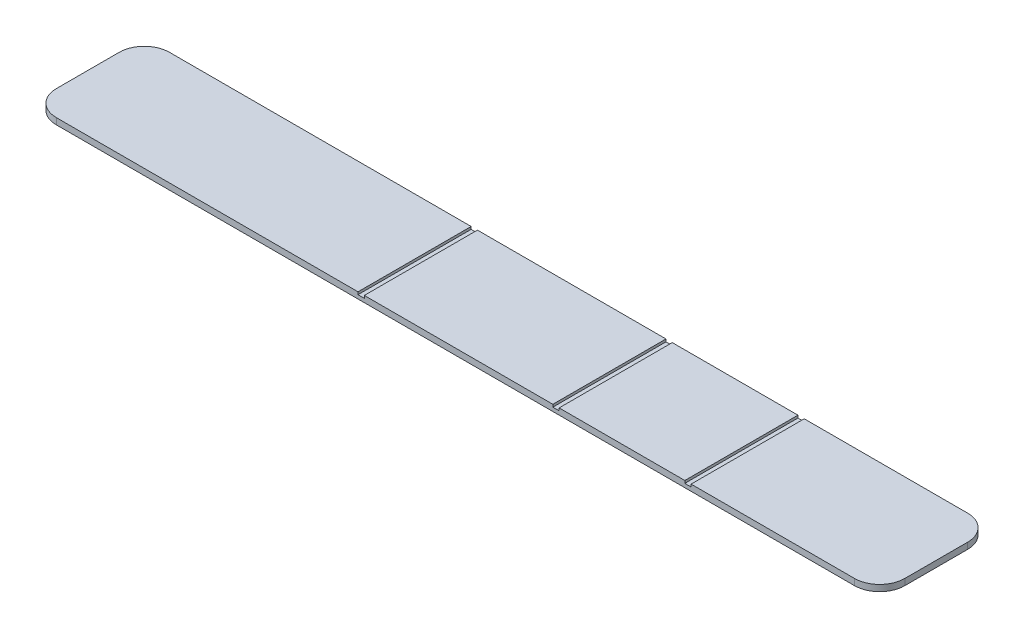
ISO-10303-21;
HEADER;
FILE_DESCRIPTION(('STEP AP214'),'2;1');
FILE_NAME('part.step','',(''),(''),'','','');
FILE_SCHEMA(('AUTOMOTIVE_DESIGN { 1 0 10303 214 1 1 1 1 }'));
ENDSEC;
DATA;
#1=APPLICATION_CONTEXT('core data for automotive mechanical design processes');
#2=APPLICATION_PROTOCOL_DEFINITION('international standard','automotive_design',2000,#1);
#3=PRODUCT_CONTEXT('',#1,'mechanical');
#4=PRODUCT('Part','Part','',(#3));
#5=PRODUCT_RELATED_PRODUCT_CATEGORY('part','',(#4));
#6=PRODUCT_DEFINITION_FORMATION('','',#4);
#7=PRODUCT_DEFINITION_CONTEXT('part definition',#1,'design');
#8=PRODUCT_DEFINITION('design','',#6,#7);
#9=PRODUCT_DEFINITION_SHAPE('','',#8);
#10=(LENGTH_UNIT() NAMED_UNIT(*) SI_UNIT(.MILLI.,.METRE.));
#11=(NAMED_UNIT(*) PLANE_ANGLE_UNIT() SI_UNIT($,.RADIAN.));
#12=(NAMED_UNIT(*) SI_UNIT($,.STERADIAN.) SOLID_ANGLE_UNIT());
#13=UNCERTAINTY_MEASURE_WITH_UNIT(LENGTH_MEASURE(1.E-05),#10,'distance_accuracy_value','');
#14=(GEOMETRIC_REPRESENTATION_CONTEXT(3) GLOBAL_UNCERTAINTY_ASSIGNED_CONTEXT((#13)) GLOBAL_UNIT_ASSIGNED_CONTEXT((#10,
#11,#12)) REPRESENTATION_CONTEXT('',''));
#15=CARTESIAN_POINT('',(0.,0.,0.));
#16=DIRECTION('',(0.,0.,1.));
#17=DIRECTION('',(1.,0.,0.));
#18=AXIS2_PLACEMENT_3D('',#15,#16,#17);
#19=CARTESIAN_POINT('',(0.,1.,0.));
#20=DIRECTION('',(0.,1.,0.));
#21=DIRECTION('',(0.,0.,1.));
#22=AXIS2_PLACEMENT_3D('',#19,#20,#21);
#23=PLANE('',#22);
#24=DIRECTION('',(1.,0.,0.));
#25=VECTOR('',#24,1.);
#26=CARTESIAN_POINT('',(0.,1.,-18.));
#27=LINE('',#26,#25);
#28=CARTESIAN_POINT('',(4.,1.,-18.));
#29=VERTEX_POINT('',#28);
#30=CARTESIAN_POINT('',(52.,1.,-18.));
#31=VERTEX_POINT('',#30);
#32=EDGE_CURVE('E271',#29,#31,#27,.T.);
#33=ORIENTED_EDGE('',*,*,#32,.F.);
#34=CARTESIAN_POINT('',(4.,1.,-14.));
#35=DIRECTION('',(0.,1.,0.));
#36=DIRECTION('',(0.,0.,1.));
#37=AXIS2_PLACEMENT_3D('',#34,#35,#36);
#38=CIRCLE('',#37,4.);
#39=CARTESIAN_POINT('',(0.,1.,-14.));
#40=VERTEX_POINT('',#39);
#41=EDGE_CURVE('E11',#29,#40,#38,.T.);
#42=ORIENTED_EDGE('',*,*,#41,.T.);
#43=DIRECTION('',(0.,0.,-1.));
#44=VECTOR('',#43,1.);
#45=CARTESIAN_POINT('',(0.,1.,0.));
#46=LINE('',#45,#44);
#47=CARTESIAN_POINT('',(0.,1.,-4.));
#48=VERTEX_POINT('',#47);
#49=EDGE_CURVE('E273',#48,#40,#46,.T.);
#50=ORIENTED_EDGE('',*,*,#49,.F.);
#51=CARTESIAN_POINT('',(4.,1.,-4.));
#52=DIRECTION('',(0.,1.,0.));
#53=DIRECTION('',(0.,0.,1.));
#54=AXIS2_PLACEMENT_3D('',#51,#52,#53);
#55=CIRCLE('',#54,4.);
#56=CARTESIAN_POINT('',(4.,1.,0.));
#57=VERTEX_POINT('',#56);
#58=EDGE_CURVE('E41',#48,#57,#55,.T.);
#59=ORIENTED_EDGE('',*,*,#58,.T.);
#60=DIRECTION('',(1.,0.,0.));
#61=VECTOR('',#60,1.);
#62=CARTESIAN_POINT('',(0.,1.,0.));
#63=LINE('',#62,#61);
#64=CARTESIAN_POINT('',(52.,1.,0.));
#65=VERTEX_POINT('',#64);
#66=EDGE_CURVE('E263',#57,#65,#63,.T.);
#67=ORIENTED_EDGE('',*,*,#66,.T.);
#68=DIRECTION('',(0.,0.,1.));
#69=VECTOR('',#68,1.);
#70=CARTESIAN_POINT('',(52.,1.,-18.));
#71=LINE('',#70,#69);
#72=EDGE_CURVE('E177',#31,#65,#71,.T.);
#73=ORIENTED_EDGE('',*,*,#72,.F.);
#74=EDGE_LOOP('',(#33,#42,#50,#59,#67,#73));
#75=FACE_BOUND('',#74,.T.);
#76=ADVANCED_FACE('F33',(#75),#23,.T.);
#77=DIRECTION('',(0.,0.,-1.));
#78=VECTOR('',#77,1.);
#79=CARTESIAN_POINT('',(53.,1.,-18.));
#80=LINE('',#79,#78);
#81=CARTESIAN_POINT('',(53.,1.,0.));
#82=VERTEX_POINT('',#81);
#83=CARTESIAN_POINT('',(53.,1.,-18.));
#84=VERTEX_POINT('',#83);
#85=EDGE_CURVE('E192',#82,#84,#80,.T.);
#86=ORIENTED_EDGE('',*,*,#85,.F.);
#87=CARTESIAN_POINT('',(83.,1.,0.));
#88=VERTEX_POINT('',#87);
#89=EDGE_CURVE('E266',#82,#88,#63,.T.);
#90=ORIENTED_EDGE('',*,*,#89,.T.);
#91=DIRECTION('',(0.,0.,1.));
#92=VECTOR('',#91,1.);
#93=CARTESIAN_POINT('',(83.,1.,-18.));
#94=LINE('',#93,#92);
#95=CARTESIAN_POINT('',(83.,1.,-18.));
#96=VERTEX_POINT('',#95);
#97=EDGE_CURVE('E226',#96,#88,#94,.T.);
#98=ORIENTED_EDGE('',*,*,#97,.F.);
#99=EDGE_CURVE('E274',#84,#96,#27,.T.);
#100=ORIENTED_EDGE('',*,*,#99,.F.);
#101=EDGE_LOOP('',(#86,#90,#98,#100));
#102=FACE_BOUND('',#101,.T.);
#103=ADVANCED_FACE('F362',(#102),#23,.T.);
#104=DIRECTION('',(0.,0.,-1.));
#105=VECTOR('',#104,1.);
#106=CARTESIAN_POINT('',(84.,1.,-18.));
#107=LINE('',#106,#105);
#108=CARTESIAN_POINT('',(84.,1.,0.));
#109=VERTEX_POINT('',#108);
#110=CARTESIAN_POINT('',(84.,1.,-18.));
#111=VERTEX_POINT('',#110);
#112=EDGE_CURVE('E216',#109,#111,#107,.T.);
#113=ORIENTED_EDGE('',*,*,#112,.F.);
#114=CARTESIAN_POINT('',(104.,1.,0.));
#115=VERTEX_POINT('',#114);
#116=EDGE_CURVE('E352',#109,#115,#63,.T.);
#117=ORIENTED_EDGE('',*,*,#116,.T.);
#118=DIRECTION('',(0.,0.,1.));
#119=VECTOR('',#118,1.);
#120=CARTESIAN_POINT('',(104.,1.,-18.));
#121=LINE('',#120,#119);
#122=CARTESIAN_POINT('',(104.,1.,-18.));
#123=VERTEX_POINT('',#122);
#124=EDGE_CURVE('E252',#123,#115,#121,.T.);
#125=ORIENTED_EDGE('',*,*,#124,.F.);
#126=EDGE_CURVE('E373',#111,#123,#27,.T.);
#127=ORIENTED_EDGE('',*,*,#126,.F.);
#128=EDGE_LOOP('',(#113,#117,#125,#127));
#129=FACE_BOUND('',#128,.T.);
#130=ADVANCED_FACE('F378',(#129),#23,.T.);
#131=CARTESIAN_POINT('',(0.,1.,0.));
#132=DIRECTION('',(0.,0.,-1.));
#133=DIRECTION('',(-1.,0.,0.));
#134=AXIS2_PLACEMENT_3D('',#131,#132,#133);
#135=PLANE('',#134);
#136=DIRECTION('',(1.,0.,0.));
#137=VECTOR('',#136,1.);
#138=CARTESIAN_POINT('',(0.,0.,0.));
#139=LINE('',#138,#137);
#140=CARTESIAN_POINT('',(4.,0.,0.));
#141=VERTEX_POINT('',#140);
#142=CARTESIAN_POINT('',(131.,0.,0.));
#143=VERTEX_POINT('',#142);
#144=EDGE_CURVE('E207',#141,#143,#139,.T.);
#145=ORIENTED_EDGE('',*,*,#144,.T.);
#146=DIRECTION('',(0.,-1.,0.));
#147=VECTOR('',#146,1.);
#148=CARTESIAN_POINT('',(131.,1.,0.));
#149=LINE('',#148,#147);
#150=CARTESIAN_POINT('',(131.,1.,0.));
#151=VERTEX_POINT('',#150);
#152=EDGE_CURVE('E311',#143,#151,#149,.F.);
#153=ORIENTED_EDGE('',*,*,#152,.T.);
#154=CARTESIAN_POINT('',(105.,1.,0.));
#155=VERTEX_POINT('',#154);
#156=EDGE_CURVE('E267',#155,#151,#63,.T.);
#157=ORIENTED_EDGE('',*,*,#156,.F.);
#158=DIRECTION('',(0.,1.,0.));
#159=VECTOR('',#158,1.);
#160=CARTESIAN_POINT('',(105.,0.6,0.));
#161=LINE('',#160,#159);
#162=CARTESIAN_POINT('',(105.,0.6,0.));
#163=VERTEX_POINT('',#162);
#164=EDGE_CURVE('E259',#163,#155,#161,.T.);
#165=ORIENTED_EDGE('',*,*,#164,.F.);
#166=DIRECTION('',(1.,0.,0.));
#167=VECTOR('',#166,1.);
#168=CARTESIAN_POINT('',(104.,0.6,0.));
#169=LINE('',#168,#167);
#170=CARTESIAN_POINT('',(104.,0.6,0.));
#171=VERTEX_POINT('',#170);
#172=EDGE_CURVE('E241',#171,#163,#169,.T.);
#173=ORIENTED_EDGE('',*,*,#172,.F.);
#174=DIRECTION('',(0.,1.,0.));
#175=VECTOR('',#174,1.);
#176=CARTESIAN_POINT('',(104.,0.6,0.));
#177=LINE('',#176,#175);
#178=EDGE_CURVE('E251',#171,#115,#177,.T.);
#179=ORIENTED_EDGE('',*,*,#178,.T.);
#180=ORIENTED_EDGE('',*,*,#116,.F.);
#181=DIRECTION('',(0.,1.,0.));
#182=VECTOR('',#181,1.);
#183=CARTESIAN_POINT('',(84.,0.6,0.));
#184=LINE('',#183,#182);
#185=CARTESIAN_POINT('',(84.,0.6,0.));
#186=VERTEX_POINT('',#185);
#187=EDGE_CURVE('E234',#186,#109,#184,.T.);
#188=ORIENTED_EDGE('',*,*,#187,.F.);
#189=DIRECTION('',(1.,0.,0.));
#190=VECTOR('',#189,1.);
#191=CARTESIAN_POINT('',(83.,0.6,0.));
#192=LINE('',#191,#190);
#193=CARTESIAN_POINT('',(83.,0.6,0.));
#194=VERTEX_POINT('',#193);
#195=EDGE_CURVE('E215',#194,#186,#192,.T.);
#196=ORIENTED_EDGE('',*,*,#195,.F.);
#197=DIRECTION('',(0.,1.,0.));
#198=VECTOR('',#197,1.);
#199=CARTESIAN_POINT('',(83.,0.6,0.));
#200=LINE('',#199,#198);
#201=EDGE_CURVE('E225',#194,#88,#200,.T.);
#202=ORIENTED_EDGE('',*,*,#201,.T.);
#203=ORIENTED_EDGE('',*,*,#89,.F.);
#204=DIRECTION('',(0.,1.,0.));
#205=VECTOR('',#204,1.);
#206=CARTESIAN_POINT('',(53.,0.6,0.));
#207=LINE('',#206,#205);
#208=CARTESIAN_POINT('',(53.,0.6,0.));
#209=VERTEX_POINT('',#208);
#210=EDGE_CURVE('E181',#209,#82,#207,.T.);
#211=ORIENTED_EDGE('',*,*,#210,.F.);
#212=DIRECTION('',(1.,0.,0.));
#213=VECTOR('',#212,1.);
#214=CARTESIAN_POINT('',(52.,0.6,0.));
#215=LINE('',#214,#213);
#216=CARTESIAN_POINT('',(52.,0.6,0.));
#217=VERTEX_POINT('',#216);
#218=EDGE_CURVE('E188',#217,#209,#215,.T.);
#219=ORIENTED_EDGE('',*,*,#218,.F.);
#220=DIRECTION('',(0.,1.,0.));
#221=VECTOR('',#220,1.);
#222=CARTESIAN_POINT('',(52.,0.6,0.));
#223=LINE('',#222,#221);
#224=EDGE_CURVE('E170',#217,#65,#223,.T.);
#225=ORIENTED_EDGE('',*,*,#224,.T.);
#226=ORIENTED_EDGE('',*,*,#66,.F.);
#227=DIRECTION('',(0.,-1.,0.));
#228=VECTOR('',#227,1.);
#229=CARTESIAN_POINT('',(4.,0.,0.));
#230=LINE('',#229,#228);
#231=EDGE_CURVE('E308',#57,#141,#230,.T.);
#232=ORIENTED_EDGE('',*,*,#231,.T.);
#233=EDGE_LOOP('',(#145,#153,#157,#165,#173,#179,#180,#188,#196,#202,#203,#211,#219,#225,#226,#232));
#234=FACE_BOUND('',#233,.T.);
#235=ADVANCED_FACE('F195',(#234),#135,.F.);
#236=CARTESIAN_POINT('',(135.,1.,0.));
#237=DIRECTION('',(-1.,0.,0.));
#238=DIRECTION('',(0.,0.,1.));
#239=AXIS2_PLACEMENT_3D('',#236,#237,#238);
#240=PLANE('',#239);
#241=DIRECTION('',(0.,0.,-1.));
#242=VECTOR('',#241,1.);
#243=CARTESIAN_POINT('',(135.,0.,0.));
#244=LINE('',#243,#242);
#245=CARTESIAN_POINT('',(135.,0.,-4.));
#246=VERTEX_POINT('',#245);
#247=CARTESIAN_POINT('',(135.,0.,-14.));
#248=VERTEX_POINT('',#247);
#249=EDGE_CURVE('E278',#246,#248,#244,.T.);
#250=ORIENTED_EDGE('',*,*,#249,.T.);
#251=DIRECTION('',(0.,-1.,0.));
#252=VECTOR('',#251,1.);
#253=CARTESIAN_POINT('',(135.,1.,-14.));
#254=LINE('',#253,#252);
#255=CARTESIAN_POINT('',(135.,1.,-14.));
#256=VERTEX_POINT('',#255);
#257=EDGE_CURVE('E302',#248,#256,#254,.F.);
#258=ORIENTED_EDGE('',*,*,#257,.T.);
#259=DIRECTION('',(0.,0.,-1.));
#260=VECTOR('',#259,1.);
#261=CARTESIAN_POINT('',(135.,1.,0.));
#262=LINE('',#261,#260);
#263=CARTESIAN_POINT('',(135.,1.,-4.));
#264=VERTEX_POINT('',#263);
#265=EDGE_CURVE('E265',#264,#256,#262,.T.);
#266=ORIENTED_EDGE('',*,*,#265,.F.);
#267=DIRECTION('',(0.,-1.,0.));
#268=VECTOR('',#267,1.);
#269=CARTESIAN_POINT('',(135.,1.,-4.));
#270=LINE('',#269,#268);
#271=EDGE_CURVE('E299',#264,#246,#270,.T.);
#272=ORIENTED_EDGE('',*,*,#271,.T.);
#273=EDGE_LOOP('',(#250,#258,#266,#272));
#274=FACE_BOUND('',#273,.T.);
#275=ADVANCED_FACE('F339',(#274),#240,.F.);
#276=CARTESIAN_POINT('',(0.,1.,-18.));
#277=DIRECTION('',(0.,0.,-1.));
#278=DIRECTION('',(-1.,0.,0.));
#279=AXIS2_PLACEMENT_3D('',#276,#277,#278);
#280=PLANE('',#279);
#281=CARTESIAN_POINT('',(105.,1.,-18.));
#282=VERTEX_POINT('',#281);
#283=CARTESIAN_POINT('',(131.,1.,-18.));
#284=VERTEX_POINT('',#283);
#285=EDGE_CURVE('E270',#282,#284,#27,.T.);
#286=ORIENTED_EDGE('',*,*,#285,.T.);
#287=DIRECTION('',(0.,-1.,0.));
#288=VECTOR('',#287,1.);
#289=CARTESIAN_POINT('',(131.,0.,-18.));
#290=LINE('',#289,#288);
#291=CARTESIAN_POINT('',(131.,0.,-18.));
#292=VERTEX_POINT('',#291);
#293=EDGE_CURVE('E288',#284,#292,#290,.T.);
#294=ORIENTED_EDGE('',*,*,#293,.T.);
#295=DIRECTION('',(1.,0.,0.));
#296=VECTOR('',#295,1.);
#297=CARTESIAN_POINT('',(0.,0.,-18.));
#298=LINE('',#297,#296);
#299=CARTESIAN_POINT('',(4.,0.,-18.));
#300=VERTEX_POINT('',#299);
#301=EDGE_CURVE('E281',#300,#292,#298,.T.);
#302=ORIENTED_EDGE('',*,*,#301,.F.);
#303=DIRECTION('',(0.,-1.,0.));
#304=VECTOR('',#303,1.);
#305=CARTESIAN_POINT('',(4.,1.,-18.));
#306=LINE('',#305,#304);
#307=EDGE_CURVE('E276',#300,#29,#306,.F.);
#308=ORIENTED_EDGE('',*,*,#307,.T.);
#309=ORIENTED_EDGE('',*,*,#32,.T.);
#310=DIRECTION('',(0.,1.,0.));
#311=VECTOR('',#310,1.);
#312=CARTESIAN_POINT('',(52.,0.6,-18.));
#313=LINE('',#312,#311);
#314=CARTESIAN_POINT('',(52.,0.6,-18.));
#315=VERTEX_POINT('',#314);
#316=EDGE_CURVE('E205',#315,#31,#313,.T.);
#317=ORIENTED_EDGE('',*,*,#316,.F.);
#318=DIRECTION('',(-1.,0.,0.));
#319=VECTOR('',#318,1.);
#320=CARTESIAN_POINT('',(52.,0.6,-18.));
#321=LINE('',#320,#319);
#322=CARTESIAN_POINT('',(53.,0.6,-18.));
#323=VERTEX_POINT('',#322);
#324=EDGE_CURVE('E182',#323,#315,#321,.T.);
#325=ORIENTED_EDGE('',*,*,#324,.F.);
#326=DIRECTION('',(0.,1.,0.));
#327=VECTOR('',#326,1.);
#328=CARTESIAN_POINT('',(53.,0.6,-18.));
#329=LINE('',#328,#327);
#330=EDGE_CURVE('E208',#323,#84,#329,.T.);
#331=ORIENTED_EDGE('',*,*,#330,.T.);
#332=ORIENTED_EDGE('',*,*,#99,.T.);
#333=DIRECTION('',(0.,1.,0.));
#334=VECTOR('',#333,1.);
#335=CARTESIAN_POINT('',(83.,0.6,-18.));
#336=LINE('',#335,#334);
#337=CARTESIAN_POINT('',(83.,0.6,-18.));
#338=VERTEX_POINT('',#337);
#339=EDGE_CURVE('E203',#338,#96,#336,.T.);
#340=ORIENTED_EDGE('',*,*,#339,.F.);
#341=DIRECTION('',(-1.,0.,0.));
#342=VECTOR('',#341,1.);
#343=CARTESIAN_POINT('',(83.,0.6,-18.));
#344=LINE('',#343,#342);
#345=CARTESIAN_POINT('',(84.,0.6,-18.));
#346=VERTEX_POINT('',#345);
#347=EDGE_CURVE('E222',#346,#338,#344,.T.);
#348=ORIENTED_EDGE('',*,*,#347,.F.);
#349=DIRECTION('',(0.,1.,0.));
#350=VECTOR('',#349,1.);
#351=CARTESIAN_POINT('',(84.,0.6,-18.));
#352=LINE('',#351,#350);
#353=EDGE_CURVE('E231',#346,#111,#352,.T.);
#354=ORIENTED_EDGE('',*,*,#353,.T.);
#355=ORIENTED_EDGE('',*,*,#126,.T.);
#356=DIRECTION('',(0.,1.,0.));
#357=VECTOR('',#356,1.);
#358=CARTESIAN_POINT('',(104.,0.6,-18.));
#359=LINE('',#358,#357);
#360=CARTESIAN_POINT('',(104.,0.6,-18.));
#361=VERTEX_POINT('',#360);
#362=EDGE_CURVE('E228',#361,#123,#359,.T.);
#363=ORIENTED_EDGE('',*,*,#362,.F.);
#364=DIRECTION('',(-1.,0.,0.));
#365=VECTOR('',#364,1.);
#366=CARTESIAN_POINT('',(104.,0.6,-18.));
#367=LINE('',#366,#365);
#368=CARTESIAN_POINT('',(105.,0.6,-18.));
#369=VERTEX_POINT('',#368);
#370=EDGE_CURVE('E248',#369,#361,#367,.T.);
#371=ORIENTED_EDGE('',*,*,#370,.F.);
#372=DIRECTION('',(0.,1.,0.));
#373=VECTOR('',#372,1.);
#374=CARTESIAN_POINT('',(105.,0.6,-18.));
#375=LINE('',#374,#373);
#376=EDGE_CURVE('E256',#369,#282,#375,.T.);
#377=ORIENTED_EDGE('',*,*,#376,.T.);
#378=EDGE_LOOP('',(#286,#294,#302,#308,#309,#317,#325,#331,#332,#340,#348,#354,#355,#363,#371,#377));
#379=FACE_BOUND('',#378,.T.);
#380=ADVANCED_FACE('F330',(#379),#280,.T.);
#381=CARTESIAN_POINT('',(0.,1.,0.));
#382=DIRECTION('',(-1.,0.,0.));
#383=DIRECTION('',(0.,0.,1.));
#384=AXIS2_PLACEMENT_3D('',#381,#382,#383);
#385=PLANE('',#384);
#386=ORIENTED_EDGE('',*,*,#49,.T.);
#387=DIRECTION('',(0.,-1.,0.));
#388=VECTOR('',#387,1.);
#389=CARTESIAN_POINT('',(0.,1.,-14.));
#390=LINE('',#389,#388);
#391=CARTESIAN_POINT('',(0.,0.,-14.));
#392=VERTEX_POINT('',#391);
#393=EDGE_CURVE('E314',#40,#392,#390,.T.);
#394=ORIENTED_EDGE('',*,*,#393,.T.);
#395=DIRECTION('',(0.,0.,-1.));
#396=VECTOR('',#395,1.);
#397=CARTESIAN_POINT('',(0.,0.,0.));
#398=LINE('',#397,#396);
#399=CARTESIAN_POINT('',(0.,0.,-4.));
#400=VERTEX_POINT('',#399);
#401=EDGE_CURVE('E284',#400,#392,#398,.T.);
#402=ORIENTED_EDGE('',*,*,#401,.F.);
#403=DIRECTION('',(0.,-1.,0.));
#404=VECTOR('',#403,1.);
#405=CARTESIAN_POINT('',(0.,1.,-4.));
#406=LINE('',#405,#404);
#407=EDGE_CURVE('E53',#400,#48,#406,.F.);
#408=ORIENTED_EDGE('',*,*,#407,.T.);
#409=EDGE_LOOP('',(#386,#394,#402,#408));
#410=FACE_BOUND('',#409,.T.);
#411=ADVANCED_FACE('F322',(#410),#385,.T.);
#412=ORIENTED_EDGE('',*,*,#265,.T.);
#413=CARTESIAN_POINT('',(131.,1.,-14.));
#414=DIRECTION('',(0.,1.,0.));
#415=DIRECTION('',(0.,0.,1.));
#416=AXIS2_PLACEMENT_3D('',#413,#414,#415);
#417=CIRCLE('',#416,4.);
#418=EDGE_CURVE('E306',#256,#284,#417,.T.);
#419=ORIENTED_EDGE('',*,*,#418,.T.);
#420=ORIENTED_EDGE('',*,*,#285,.F.);
#421=DIRECTION('',(0.,0.,-1.));
#422=VECTOR('',#421,1.);
#423=CARTESIAN_POINT('',(105.,1.,-18.));
#424=LINE('',#423,#422);
#425=EDGE_CURVE('E242',#155,#282,#424,.T.);
#426=ORIENTED_EDGE('',*,*,#425,.F.);
#427=ORIENTED_EDGE('',*,*,#156,.T.);
#428=CARTESIAN_POINT('',(131.,1.,-4.));
#429=DIRECTION('',(0.,1.,0.));
#430=DIRECTION('',(0.,0.,1.));
#431=AXIS2_PLACEMENT_3D('',#428,#429,#430);
#432=CIRCLE('',#431,4.);
#433=EDGE_CURVE('E304',#151,#264,#432,.T.);
#434=ORIENTED_EDGE('',*,*,#433,.T.);
#435=EDGE_LOOP('',(#412,#419,#420,#426,#427,#434));
#436=FACE_BOUND('',#435,.T.);
#437=ADVANCED_FACE('F351',(#436),#23,.T.);
#438=CARTESIAN_POINT('',(0.,0.,0.));
#439=DIRECTION('',(0.,1.,0.));
#440=DIRECTION('',(0.,0.,1.));
#441=AXIS2_PLACEMENT_3D('',#438,#439,#440);
#442=PLANE('',#441);
#443=ORIENTED_EDGE('',*,*,#301,.T.);
#444=CARTESIAN_POINT('',(131.,0.,-14.));
#445=DIRECTION('',(0.,1.,0.));
#446=DIRECTION('',(0.,0.,1.));
#447=AXIS2_PLACEMENT_3D('',#444,#445,#446);
#448=CIRCLE('',#447,4.);
#449=EDGE_CURVE('E297',#292,#248,#448,.F.);
#450=ORIENTED_EDGE('',*,*,#449,.T.);
#451=ORIENTED_EDGE('',*,*,#249,.F.);
#452=CARTESIAN_POINT('',(131.,0.,-4.));
#453=DIRECTION('',(0.,1.,0.));
#454=DIRECTION('',(0.,0.,1.));
#455=AXIS2_PLACEMENT_3D('',#452,#453,#454);
#456=CIRCLE('',#455,4.);
#457=EDGE_CURVE('E295',#246,#143,#456,.F.);
#458=ORIENTED_EDGE('',*,*,#457,.T.);
#459=ORIENTED_EDGE('',*,*,#144,.F.);
#460=CARTESIAN_POINT('',(4.,0.,-4.));
#461=DIRECTION('',(0.,1.,0.));
#462=DIRECTION('',(0.,0.,1.));
#463=AXIS2_PLACEMENT_3D('',#460,#461,#462);
#464=CIRCLE('',#463,4.);
#465=EDGE_CURVE('E291',#141,#400,#464,.F.);
#466=ORIENTED_EDGE('',*,*,#465,.T.);
#467=ORIENTED_EDGE('',*,*,#401,.T.);
#468=CARTESIAN_POINT('',(4.,0.,-14.));
#469=DIRECTION('',(0.,1.,0.));
#470=DIRECTION('',(0.,0.,1.));
#471=AXIS2_PLACEMENT_3D('',#468,#469,#470);
#472=CIRCLE('',#471,4.);
#473=EDGE_CURVE('E293',#392,#300,#472,.F.);
#474=ORIENTED_EDGE('',*,*,#473,.T.);
#475=EDGE_LOOP('',(#443,#450,#451,#458,#459,#466,#467,#474));
#476=FACE_BOUND('',#475,.T.);
#477=ADVANCED_FACE('F321',(#476),#442,.F.);
#478=CARTESIAN_POINT('',(104.,0.6,-18.));
#479=DIRECTION('',(-1.,0.,0.));
#480=DIRECTION('',(0.,0.,1.));
#481=AXIS2_PLACEMENT_3D('',#478,#479,#480);
#482=PLANE('',#481);
#483=ORIENTED_EDGE('',*,*,#124,.T.);
#484=ORIENTED_EDGE('',*,*,#178,.F.);
#485=DIRECTION('',(0.,0.,1.));
#486=VECTOR('',#485,1.);
#487=CARTESIAN_POINT('',(104.,0.6,-18.));
#488=LINE('',#487,#486);
#489=EDGE_CURVE('E238',#361,#171,#488,.T.);
#490=ORIENTED_EDGE('',*,*,#489,.F.);
#491=ORIENTED_EDGE('',*,*,#362,.T.);
#492=EDGE_LOOP('',(#483,#484,#490,#491));
#493=FACE_BOUND('',#492,.T.);
#494=ADVANCED_FACE('F380',(#493),#482,.F.);
#495=CARTESIAN_POINT('',(105.,0.6,-18.));
#496=DIRECTION('',(1.,0.,0.));
#497=DIRECTION('',(0.,0.,-1.));
#498=AXIS2_PLACEMENT_3D('',#495,#496,#497);
#499=PLANE('',#498);
#500=ORIENTED_EDGE('',*,*,#425,.T.);
#501=ORIENTED_EDGE('',*,*,#376,.F.);
#502=DIRECTION('',(0.,0.,-1.));
#503=VECTOR('',#502,1.);
#504=CARTESIAN_POINT('',(105.,0.6,-18.));
#505=LINE('',#504,#503);
#506=EDGE_CURVE('E245',#163,#369,#505,.T.);
#507=ORIENTED_EDGE('',*,*,#506,.F.);
#508=ORIENTED_EDGE('',*,*,#164,.T.);
#509=EDGE_LOOP('',(#500,#501,#507,#508));
#510=FACE_BOUND('',#509,.T.);
#511=ADVANCED_FACE('F385',(#510),#499,.F.);
#512=CARTESIAN_POINT('',(0.,0.6,0.));
#513=DIRECTION('',(0.,1.,0.));
#514=DIRECTION('',(0.,0.,1.));
#515=AXIS2_PLACEMENT_3D('',#512,#513,#514);
#516=PLANE('',#515);
#517=ORIENTED_EDGE('',*,*,#489,.T.);
#518=ORIENTED_EDGE('',*,*,#172,.T.);
#519=ORIENTED_EDGE('',*,*,#506,.T.);
#520=ORIENTED_EDGE('',*,*,#370,.T.);
#521=EDGE_LOOP('',(#517,#518,#519,#520));
#522=FACE_BOUND('',#521,.T.);
#523=ADVANCED_FACE('F383',(#522),#516,.T.);
#524=CARTESIAN_POINT('',(83.,0.6,-18.));
#525=DIRECTION('',(-1.,0.,0.));
#526=DIRECTION('',(0.,0.,1.));
#527=AXIS2_PLACEMENT_3D('',#524,#525,#526);
#528=PLANE('',#527);
#529=ORIENTED_EDGE('',*,*,#97,.T.);
#530=ORIENTED_EDGE('',*,*,#201,.F.);
#531=DIRECTION('',(0.,0.,1.));
#532=VECTOR('',#531,1.);
#533=CARTESIAN_POINT('',(83.,0.6,-18.));
#534=LINE('',#533,#532);
#535=EDGE_CURVE('E212',#338,#194,#534,.T.);
#536=ORIENTED_EDGE('',*,*,#535,.F.);
#537=ORIENTED_EDGE('',*,*,#339,.T.);
#538=EDGE_LOOP('',(#529,#530,#536,#537));
#539=FACE_BOUND('',#538,.T.);
#540=ADVANCED_FACE('F368',(#539),#528,.F.);
#541=CARTESIAN_POINT('',(84.,0.6,-18.));
#542=DIRECTION('',(1.,0.,0.));
#543=DIRECTION('',(0.,0.,-1.));
#544=AXIS2_PLACEMENT_3D('',#541,#542,#543);
#545=PLANE('',#544);
#546=ORIENTED_EDGE('',*,*,#112,.T.);
#547=ORIENTED_EDGE('',*,*,#353,.F.);
#548=DIRECTION('',(0.,0.,-1.));
#549=VECTOR('',#548,1.);
#550=CARTESIAN_POINT('',(84.,0.6,-18.));
#551=LINE('',#550,#549);
#552=EDGE_CURVE('E219',#186,#346,#551,.T.);
#553=ORIENTED_EDGE('',*,*,#552,.F.);
#554=ORIENTED_EDGE('',*,*,#187,.T.);
#555=EDGE_LOOP('',(#546,#547,#553,#554));
#556=FACE_BOUND('',#555,.T.);
#557=ADVANCED_FACE('F517',(#556),#545,.F.);
#558=CARTESIAN_POINT('',(0.,0.6,0.));
#559=DIRECTION('',(0.,1.,0.));
#560=DIRECTION('',(0.,0.,1.));
#561=AXIS2_PLACEMENT_3D('',#558,#559,#560);
#562=PLANE('',#561);
#563=ORIENTED_EDGE('',*,*,#535,.T.);
#564=ORIENTED_EDGE('',*,*,#195,.T.);
#565=ORIENTED_EDGE('',*,*,#552,.T.);
#566=ORIENTED_EDGE('',*,*,#347,.T.);
#567=EDGE_LOOP('',(#563,#564,#565,#566));
#568=FACE_BOUND('',#567,.T.);
#569=ADVANCED_FACE('F370',(#568),#562,.T.);
#570=CARTESIAN_POINT('',(52.,0.6,-18.));
#571=DIRECTION('',(-1.,0.,0.));
#572=DIRECTION('',(0.,0.,1.));
#573=AXIS2_PLACEMENT_3D('',#570,#571,#572);
#574=PLANE('',#573);
#575=ORIENTED_EDGE('',*,*,#72,.T.);
#576=ORIENTED_EDGE('',*,*,#224,.F.);
#577=DIRECTION('',(0.,0.,1.));
#578=VECTOR('',#577,1.);
#579=CARTESIAN_POINT('',(52.,0.6,-18.));
#580=LINE('',#579,#578);
#581=EDGE_CURVE('E174',#315,#217,#580,.T.);
#582=ORIENTED_EDGE('',*,*,#581,.F.);
#583=ORIENTED_EDGE('',*,*,#316,.T.);
#584=EDGE_LOOP('',(#575,#576,#582,#583));
#585=FACE_BOUND('',#584,.T.);
#586=ADVANCED_FACE('F172',(#585),#574,.F.);
#587=CARTESIAN_POINT('',(53.,0.6,-18.));
#588=DIRECTION('',(1.,0.,0.));
#589=DIRECTION('',(0.,0.,-1.));
#590=AXIS2_PLACEMENT_3D('',#587,#588,#589);
#591=PLANE('',#590);
#592=ORIENTED_EDGE('',*,*,#85,.T.);
#593=ORIENTED_EDGE('',*,*,#330,.F.);
#594=DIRECTION('',(0.,0.,-1.));
#595=VECTOR('',#594,1.);
#596=CARTESIAN_POINT('',(53.,0.6,-18.));
#597=LINE('',#596,#595);
#598=EDGE_CURVE('E197',#209,#323,#597,.T.);
#599=ORIENTED_EDGE('',*,*,#598,.F.);
#600=ORIENTED_EDGE('',*,*,#210,.T.);
#601=EDGE_LOOP('',(#592,#593,#599,#600));
#602=FACE_BOUND('',#601,.T.);
#603=ADVANCED_FACE('F491',(#602),#591,.F.);
#604=CARTESIAN_POINT('',(0.,0.6,0.));
#605=DIRECTION('',(0.,1.,0.));
#606=DIRECTION('',(0.,0.,1.));
#607=AXIS2_PLACEMENT_3D('',#604,#605,#606);
#608=PLANE('',#607);
#609=ORIENTED_EDGE('',*,*,#581,.T.);
#610=ORIENTED_EDGE('',*,*,#218,.T.);
#611=ORIENTED_EDGE('',*,*,#598,.T.);
#612=ORIENTED_EDGE('',*,*,#324,.T.);
#613=EDGE_LOOP('',(#609,#610,#611,#612));
#614=FACE_BOUND('',#613,.T.);
#615=ADVANCED_FACE('F186',(#614),#608,.T.);
#616=CARTESIAN_POINT('',(131.,1.,-14.));
#617=DIRECTION('',(0.,1.,0.));
#618=DIRECTION('',(0.,0.,1.));
#619=AXIS2_PLACEMENT_3D('',#616,#617,#618);
#620=CYLINDRICAL_SURFACE('',#619,4.);
#621=ORIENTED_EDGE('',*,*,#418,.F.);
#622=ORIENTED_EDGE('',*,*,#257,.F.);
#623=ORIENTED_EDGE('',*,*,#449,.F.);
#624=ORIENTED_EDGE('',*,*,#293,.F.);
#625=EDGE_LOOP('',(#621,#622,#623,#624));
#626=FACE_BOUND('',#625,.T.);
#627=ADVANCED_FACE('F335',(#626),#620,.T.);
#628=CARTESIAN_POINT('',(131.,1.,-4.));
#629=DIRECTION('',(0.,-1.,0.));
#630=DIRECTION('',(0.,0.,-1.));
#631=AXIS2_PLACEMENT_3D('',#628,#629,#630);
#632=CYLINDRICAL_SURFACE('',#631,4.);
#633=ORIENTED_EDGE('',*,*,#433,.F.);
#634=ORIENTED_EDGE('',*,*,#152,.F.);
#635=ORIENTED_EDGE('',*,*,#457,.F.);
#636=ORIENTED_EDGE('',*,*,#271,.F.);
#637=EDGE_LOOP('',(#633,#634,#635,#636));
#638=FACE_BOUND('',#637,.T.);
#639=ADVANCED_FACE('F344',(#638),#632,.T.);
#640=CARTESIAN_POINT('',(4.,1.,-14.));
#641=DIRECTION('',(0.,-1.,0.));
#642=DIRECTION('',(0.,0.,-1.));
#643=AXIS2_PLACEMENT_3D('',#640,#641,#642);
#644=CYLINDRICAL_SURFACE('',#643,4.);
#645=ORIENTED_EDGE('',*,*,#41,.F.);
#646=ORIENTED_EDGE('',*,*,#307,.F.);
#647=ORIENTED_EDGE('',*,*,#473,.F.);
#648=ORIENTED_EDGE('',*,*,#393,.F.);
#649=EDGE_LOOP('',(#645,#646,#647,#648));
#650=FACE_BOUND('',#649,.T.);
#651=ADVANCED_FACE('F325',(#650),#644,.T.);
#652=CARTESIAN_POINT('',(4.,1.,-4.));
#653=DIRECTION('',(0.,1.,0.));
#654=DIRECTION('',(0.,0.,1.));
#655=AXIS2_PLACEMENT_3D('',#652,#653,#654);
#656=CYLINDRICAL_SURFACE('',#655,4.);
#657=ORIENTED_EDGE('',*,*,#58,.F.);
#658=ORIENTED_EDGE('',*,*,#407,.F.);
#659=ORIENTED_EDGE('',*,*,#465,.F.);
#660=ORIENTED_EDGE('',*,*,#231,.F.);
#661=EDGE_LOOP('',(#657,#658,#659,#660));
#662=FACE_BOUND('',#661,.T.);
#663=ADVANCED_FACE('F35',(#662),#656,.T.);
#664=CLOSED_SHELL('',(#76,#103,#130,#235,#275,#380,#411,#437,#477,#494,#511,#523,#540,#557,#569,
#586,#603,#615,#627,#639,#651,#663));
#665=MANIFOLD_SOLID_BREP('B2',#664);
#666=ADVANCED_BREP_SHAPE_REPRESENTATION('',(#18,#665),#14);
#667=SHAPE_DEFINITION_REPRESENTATION(#9,#666);
ENDSEC;
END-ISO-10303-21;
